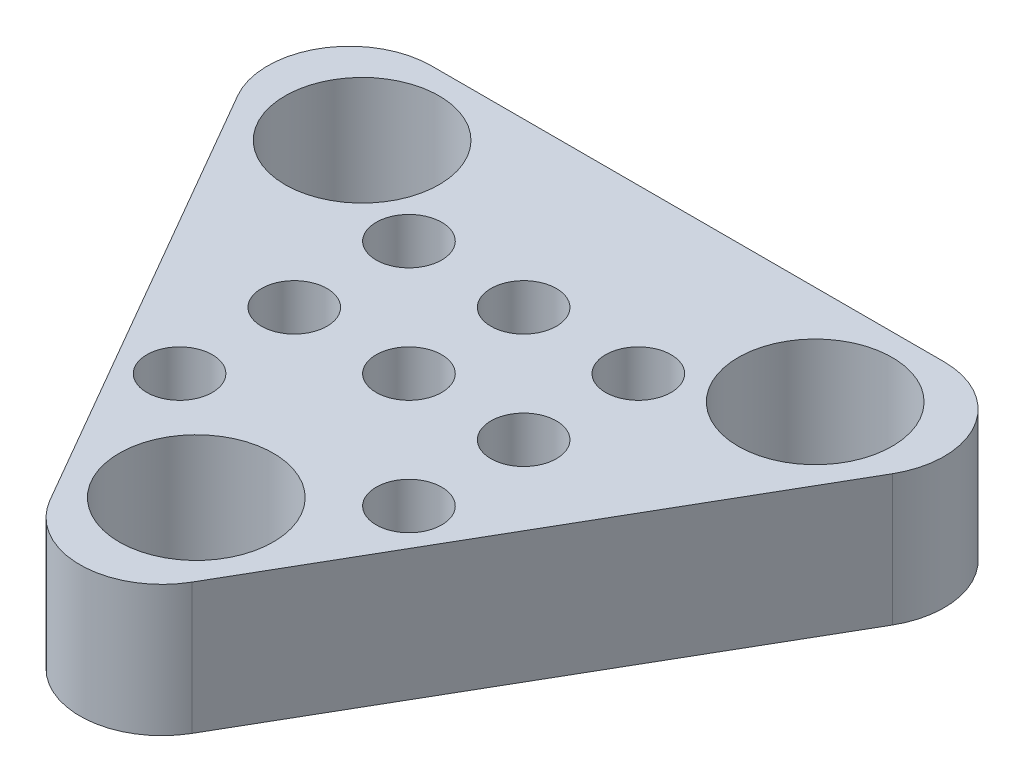
ISO-10303-21;
HEADER;
FILE_DESCRIPTION(('STEP AP214'),'2;1');
FILE_NAME('part.step','',(''),(''),'','','');
FILE_SCHEMA(('AUTOMOTIVE_DESIGN { 1 0 10303 214 1 1 1 1 }'));
ENDSEC;
DATA;
#1=APPLICATION_CONTEXT('core data for automotive mechanical design processes');
#2=APPLICATION_PROTOCOL_DEFINITION('international standard','automotive_design',2000,#1);
#3=PRODUCT_CONTEXT('',#1,'mechanical');
#4=PRODUCT('Part','Part','',(#3));
#5=PRODUCT_RELATED_PRODUCT_CATEGORY('part','',(#4));
#6=PRODUCT_DEFINITION_FORMATION('','',#4);
#7=PRODUCT_DEFINITION_CONTEXT('part definition',#1,'design');
#8=PRODUCT_DEFINITION('design','',#6,#7);
#9=PRODUCT_DEFINITION_SHAPE('','',#8);
#10=(LENGTH_UNIT() NAMED_UNIT(*) SI_UNIT(.MILLI.,.METRE.));
#11=(NAMED_UNIT(*) PLANE_ANGLE_UNIT() SI_UNIT($,.RADIAN.));
#12=(NAMED_UNIT(*) SI_UNIT($,.STERADIAN.) SOLID_ANGLE_UNIT());
#13=UNCERTAINTY_MEASURE_WITH_UNIT(LENGTH_MEASURE(1.E-05),#10,'distance_accuracy_value','');
#14=(GEOMETRIC_REPRESENTATION_CONTEXT(3) GLOBAL_UNCERTAINTY_ASSIGNED_CONTEXT((#13)) GLOBAL_UNIT_ASSIGNED_CONTEXT((#10,
#11,#12)) REPRESENTATION_CONTEXT('',''));
#15=CARTESIAN_POINT('',(0.,0.,0.));
#16=DIRECTION('',(0.,0.,1.));
#17=DIRECTION('',(1.,0.,0.));
#18=AXIS2_PLACEMENT_3D('',#15,#16,#17);
#19=CARTESIAN_POINT('',(-3.0209776379957,4.,-4.56619239929004));
#20=DIRECTION('',(0.,-1.,0.));
#21=DIRECTION('',(0.,0.,-1.));
#22=AXIS2_PLACEMENT_3D('',#19,#20,#21);
#23=PLANE('',#22);
#24=CARTESIAN_POINT('',(1.27033463203907,4.,4.91139789499105));
#25=DIRECTION('',(0.,1.,0.));
#26=DIRECTION('',(0.,0.,1.));
#27=AXIS2_PLACEMENT_3D('',#24,#25,#26);
#28=CIRCLE('',#27,0.999999999999769);
#29=CARTESIAN_POINT('',(1.27033463203907,4.,5.91139789499082));
#30=VERTEX_POINT('',#29);
#31=EDGE_CURVE('E216',#30,#30,#28,.T.);
#32=ORIENTED_EDGE('',*,*,#31,.F.);
#33=EDGE_LOOP('',(#32));
#34=FACE_BOUND('',#33,.T.);
#35=CARTESIAN_POINT('',(4.77033463203904,4.,1.41139789499105));
#36=DIRECTION('',(0.,1.,0.));
#37=DIRECTION('',(0.,0.,1.));
#38=AXIS2_PLACEMENT_3D('',#35,#36,#37);
#39=CIRCLE('',#38,0.999999999999769);
#40=CARTESIAN_POINT('',(4.77033463203904,4.,2.41139789499082));
#41=VERTEX_POINT('',#40);
#42=EDGE_CURVE('E228',#41,#41,#39,.T.);
#43=ORIENTED_EDGE('',*,*,#42,.F.);
#44=EDGE_LOOP('',(#43));
#45=FACE_BOUND('',#44,.T.);
#46=CARTESIAN_POINT('',(8.270334632039,4.,-2.08860210500895));
#47=DIRECTION('',(0.,1.,0.));
#48=DIRECTION('',(0.,0.,1.));
#49=AXIS2_PLACEMENT_3D('',#46,#47,#48);
#50=CIRCLE('',#49,0.999999999999769);
#51=CARTESIAN_POINT('',(8.270334632039,4.,-1.08860210500918));
#52=VERTEX_POINT('',#51);
#53=EDGE_CURVE('E240',#52,#52,#50,.T.);
#54=ORIENTED_EDGE('',*,*,#53,.F.);
#55=EDGE_LOOP('',(#54));
#56=FACE_BOUND('',#55,.T.);
#57=CARTESIAN_POINT('',(1.270334632039,4.,-2.08860210500895));
#58=DIRECTION('',(0.,1.,0.));
#59=DIRECTION('',(0.,0.,1.));
#60=AXIS2_PLACEMENT_3D('',#57,#58,#59);
#61=CIRCLE('',#60,0.999999999999769);
#62=CARTESIAN_POINT('',(1.270334632039,4.,-1.08860210500918));
#63=VERTEX_POINT('',#62);
#64=EDGE_CURVE('E252',#63,#63,#61,.T.);
#65=ORIENTED_EDGE('',*,*,#64,.F.);
#66=EDGE_LOOP('',(#65));
#67=FACE_BOUND('',#66,.T.);
#68=CARTESIAN_POINT('',(4.80279534308235,4.,7.93380760071011));
#69=DIRECTION('',(0.,1.,0.));
#70=DIRECTION('',(0.,0.,1.));
#71=AXIS2_PLACEMENT_3D('',#68,#69,#70);
#72=CIRCLE('',#71,2.34999999999962);
#73=CARTESIAN_POINT('',(4.80279534308235,4.,10.2838076007097));
#74=VERTEX_POINT('',#73);
#75=EDGE_CURVE('E264',#74,#74,#72,.T.);
#76=ORIENTED_EDGE('',*,*,#75,.F.);
#77=EDGE_LOOP('',(#76));
#78=FACE_BOUND('',#77,.T.);
#79=CARTESIAN_POINT('',(-3.0209776379957,4.,-4.56619239929004));
#80=DIRECTION('',(0.,1.,0.));
#81=DIRECTION('',(0.,0.,-1.));
#82=AXIS2_PLACEMENT_3D('',#79,#80,#81);
#83=CIRCLE('',#82,2.49999999999978);
#84=CARTESIAN_POINT('',(-3.02097763799564,4.,-7.0661923992899));
#85=VERTEX_POINT('',#84);
#86=CARTESIAN_POINT('',(-5.18604114745654,4.,-3.31619239929019));
#87=VERTEX_POINT('',#86);
#88=EDGE_CURVE('E127',#85,#87,#83,.T.);
#89=ORIENTED_EDGE('',*,*,#88,.T.);
#90=DIRECTION('',(0.500000000000009,0.,0.866025403784433));
#91=VECTOR('',#90,1.);
#92=CARTESIAN_POINT('',(-5.18604114745654,4.,-3.31619239929019));
#93=LINE('',#92,#91);
#94=CARTESIAN_POINT('',(2.63773183362179,4.,10.2349799108218));
#95=VERTEX_POINT('',#94);
#96=EDGE_CURVE('E85',#87,#95,#93,.T.);
#97=ORIENTED_EDGE('',*,*,#96,.T.);
#98=CARTESIAN_POINT('',(4.80279534308263,4.,8.98497991082193));
#99=DIRECTION('',(0.,1.,0.));
#100=DIRECTION('',(0.,0.,-1.));
#101=AXIS2_PLACEMENT_3D('',#98,#99,#100);
#102=CIRCLE('',#101,2.49999999999976);
#103=CARTESIAN_POINT('',(6.96785885254355,4.,10.2349799108217));
#104=VERTEX_POINT('',#103);
#105=EDGE_CURVE('E98',#95,#104,#102,.T.);
#106=ORIENTED_EDGE('',*,*,#105,.T.);
#107=DIRECTION('',(0.500000000000006,0.,-0.866025403784435));
#108=VECTOR('',#107,1.);
#109=CARTESIAN_POINT('',(6.9678588525436,4.,10.2349799108218));
#110=LINE('',#109,#108);
#111=CARTESIAN_POINT('',(14.7916318336219,4.,-3.3161923992902));
#112=VERTEX_POINT('',#111);
#113=EDGE_CURVE('E92',#104,#112,#110,.T.);
#114=ORIENTED_EDGE('',*,*,#113,.T.);
#115=CARTESIAN_POINT('',(12.6265683241609,4.,-4.56619239929004));
#116=DIRECTION('',(0.,1.,0.));
#117=DIRECTION('',(0.,0.,1.));
#118=AXIS2_PLACEMENT_3D('',#115,#116,#117);
#119=CIRCLE('',#118,2.49999999999983);
#120=CARTESIAN_POINT('',(12.626568324161,4.,-7.06619239928987));
#121=VERTEX_POINT('',#120);
#122=EDGE_CURVE('E96',#112,#121,#119,.T.);
#123=ORIENTED_EDGE('',*,*,#122,.T.);
#124=DIRECTION('',(-1.,0.,0.));
#125=VECTOR('',#124,1.);
#126=CARTESIAN_POINT('',(12.626568324161,4.,-7.0661923992899));
#127=LINE('',#126,#125);
#128=EDGE_CURVE('E48',#121,#85,#127,.T.);
#129=ORIENTED_EDGE('',*,*,#128,.T.);
#130=EDGE_LOOP('',(#89,#97,#106,#114,#123,#129));
#131=FACE_BOUND('',#130,.T.);
#132=CARTESIAN_POINT('',(-2.11063571368384,4.,-4.04060624423422));
#133=DIRECTION('',(0.,1.,0.));
#134=DIRECTION('',(0.,0.,1.));
#135=AXIS2_PLACEMENT_3D('',#132,#133,#134);
#136=CIRCLE('',#135,2.34999999999933);
#137=CARTESIAN_POINT('',(-2.11063571368384,4.,-1.69060624423489));
#138=VERTEX_POINT('',#137);
#139=EDGE_CURVE('E120',#138,#138,#136,.T.);
#140=ORIENTED_EDGE('',*,*,#139,.F.);
#141=EDGE_LOOP('',(#140));
#142=FACE_BOUND('',#141,.T.);
#143=CARTESIAN_POINT('',(11.7162263998492,4.,-4.04060624423421));
#144=DIRECTION('',(0.,1.,0.));
#145=DIRECTION('',(0.,0.,1.));
#146=AXIS2_PLACEMENT_3D('',#143,#144,#145);
#147=CIRCLE('',#146,2.34999999999945);
#148=CARTESIAN_POINT('',(11.7162263998492,4.,-1.69060624423475));
#149=VERTEX_POINT('',#148);
#150=EDGE_CURVE('E258',#149,#149,#147,.T.);
#151=ORIENTED_EDGE('',*,*,#150,.F.);
#152=EDGE_LOOP('',(#151));
#153=FACE_BOUND('',#152,.T.);
#154=CARTESIAN_POINT('',(4.770334632039,4.,-2.08860210500895));
#155=DIRECTION('',(0.,1.,0.));
#156=DIRECTION('',(0.,0.,1.));
#157=AXIS2_PLACEMENT_3D('',#154,#155,#156);
#158=CIRCLE('',#157,0.999999999999769);
#159=CARTESIAN_POINT('',(4.770334632039,4.,-1.08860210500918));
#160=VERTEX_POINT('',#159);
#161=EDGE_CURVE('E246',#160,#160,#158,.T.);
#162=ORIENTED_EDGE('',*,*,#161,.F.);
#163=EDGE_LOOP('',(#162));
#164=FACE_BOUND('',#163,.T.);
#165=CARTESIAN_POINT('',(1.27033463203904,4.,1.41139789499105));
#166=DIRECTION('',(0.,1.,0.));
#167=DIRECTION('',(0.,0.,1.));
#168=AXIS2_PLACEMENT_3D('',#165,#166,#167);
#169=CIRCLE('',#168,0.999999999999769);
#170=CARTESIAN_POINT('',(1.27033463203904,4.,2.41139789499082));
#171=VERTEX_POINT('',#170);
#172=EDGE_CURVE('E234',#171,#171,#169,.T.);
#173=ORIENTED_EDGE('',*,*,#172,.F.);
#174=EDGE_LOOP('',(#173));
#175=FACE_BOUND('',#174,.T.);
#176=CARTESIAN_POINT('',(8.27033463203903,4.,1.41139789499105));
#177=DIRECTION('',(0.,1.,0.));
#178=DIRECTION('',(0.,0.,1.));
#179=AXIS2_PLACEMENT_3D('',#176,#177,#178);
#180=CIRCLE('',#179,0.99999999999977);
#181=CARTESIAN_POINT('',(8.27033463203903,4.,2.41139789499083));
#182=VERTEX_POINT('',#181);
#183=EDGE_CURVE('E222',#182,#182,#180,.T.);
#184=ORIENTED_EDGE('',*,*,#183,.F.);
#185=EDGE_LOOP('',(#184));
#186=FACE_BOUND('',#185,.T.);
#187=CARTESIAN_POINT('',(8.27033463203907,4.,4.91139789499105));
#188=DIRECTION('',(0.,1.,0.));
#189=DIRECTION('',(0.,0.,1.));
#190=AXIS2_PLACEMENT_3D('',#187,#188,#189);
#191=CIRCLE('',#190,0.99999999999977);
#192=CARTESIAN_POINT('',(8.27033463203907,4.,5.91139789499083));
#193=VERTEX_POINT('',#192);
#194=EDGE_CURVE('E207',#193,#193,#191,.T.);
#195=ORIENTED_EDGE('',*,*,#194,.F.);
#196=EDGE_LOOP('',(#195));
#197=FACE_BOUND('',#196,.T.);
#198=ADVANCED_FACE('F31',(#34,#45,#56,#67,#78,#131,#142,#153,#164,#175,#186,#197),#23,.F.);
#199=CARTESIAN_POINT('',(-3.0209776379957,0.,-4.56619239929004));
#200=DIRECTION('',(0.,-1.,0.));
#201=DIRECTION('',(0.,0.,-1.));
#202=AXIS2_PLACEMENT_3D('',#199,#200,#201);
#203=PLANE('',#202);
#204=CARTESIAN_POINT('',(1.27033463203907,0.,4.91139789499105));
#205=DIRECTION('',(0.,1.,0.));
#206=DIRECTION('',(0.,0.,1.));
#207=AXIS2_PLACEMENT_3D('',#204,#205,#206);
#208=CIRCLE('',#207,0.999999999999769);
#209=CARTESIAN_POINT('',(1.27033463203907,0.,5.91139789499082));
#210=VERTEX_POINT('',#209);
#211=EDGE_CURVE('E213',#210,#210,#208,.T.);
#212=ORIENTED_EDGE('',*,*,#211,.T.);
#213=EDGE_LOOP('',(#212));
#214=FACE_BOUND('',#213,.T.);
#215=CARTESIAN_POINT('',(4.77033463203904,0.,1.41139789499105));
#216=DIRECTION('',(0.,1.,0.));
#217=DIRECTION('',(0.,0.,1.));
#218=AXIS2_PLACEMENT_3D('',#215,#216,#217);
#219=CIRCLE('',#218,0.999999999999769);
#220=CARTESIAN_POINT('',(4.77033463203904,0.,2.41139789499082));
#221=VERTEX_POINT('',#220);
#222=EDGE_CURVE('E225',#221,#221,#219,.T.);
#223=ORIENTED_EDGE('',*,*,#222,.T.);
#224=EDGE_LOOP('',(#223));
#225=FACE_BOUND('',#224,.T.);
#226=CARTESIAN_POINT('',(8.270334632039,0.,-2.08860210500895));
#227=DIRECTION('',(0.,1.,0.));
#228=DIRECTION('',(0.,0.,1.));
#229=AXIS2_PLACEMENT_3D('',#226,#227,#228);
#230=CIRCLE('',#229,0.999999999999769);
#231=CARTESIAN_POINT('',(8.270334632039,0.,-1.08860210500918));
#232=VERTEX_POINT('',#231);
#233=EDGE_CURVE('E237',#232,#232,#230,.T.);
#234=ORIENTED_EDGE('',*,*,#233,.T.);
#235=EDGE_LOOP('',(#234));
#236=FACE_BOUND('',#235,.T.);
#237=CARTESIAN_POINT('',(1.270334632039,0.,-2.08860210500895));
#238=DIRECTION('',(0.,1.,0.));
#239=DIRECTION('',(0.,0.,1.));
#240=AXIS2_PLACEMENT_3D('',#237,#238,#239);
#241=CIRCLE('',#240,0.999999999999769);
#242=CARTESIAN_POINT('',(1.270334632039,0.,-1.08860210500918));
#243=VERTEX_POINT('',#242);
#244=EDGE_CURVE('E249',#243,#243,#241,.T.);
#245=ORIENTED_EDGE('',*,*,#244,.T.);
#246=EDGE_LOOP('',(#245));
#247=FACE_BOUND('',#246,.T.);
#248=CARTESIAN_POINT('',(4.80279534308235,0.,7.93380760071011));
#249=DIRECTION('',(0.,1.,0.));
#250=DIRECTION('',(0.,0.,1.));
#251=AXIS2_PLACEMENT_3D('',#248,#249,#250);
#252=CIRCLE('',#251,2.34999999999962);
#253=CARTESIAN_POINT('',(4.80279534308235,0.,10.2838076007097));
#254=VERTEX_POINT('',#253);
#255=EDGE_CURVE('E261',#254,#254,#252,.T.);
#256=ORIENTED_EDGE('',*,*,#255,.T.);
#257=EDGE_LOOP('',(#256));
#258=FACE_BOUND('',#257,.T.);
#259=CARTESIAN_POINT('',(-3.0209776379957,0.,-4.56619239929004));
#260=DIRECTION('',(0.,1.,0.));
#261=DIRECTION('',(0.,0.,-1.));
#262=AXIS2_PLACEMENT_3D('',#259,#260,#261);
#263=CIRCLE('',#262,2.49999999999978);
#264=CARTESIAN_POINT('',(-3.02097763799564,0.,-7.0661923992899));
#265=VERTEX_POINT('',#264);
#266=CARTESIAN_POINT('',(-5.18604114745654,0.,-3.31619239929019));
#267=VERTEX_POINT('',#266);
#268=EDGE_CURVE('E116',#265,#267,#263,.T.);
#269=ORIENTED_EDGE('',*,*,#268,.F.);
#270=DIRECTION('',(-1.,0.,0.));
#271=VECTOR('',#270,1.);
#272=CARTESIAN_POINT('',(12.626568324161,0.,-7.0661923992899));
#273=LINE('',#272,#271);
#274=CARTESIAN_POINT('',(12.626568324161,0.,-7.06619239928987));
#275=VERTEX_POINT('',#274);
#276=EDGE_CURVE('E77',#275,#265,#273,.T.);
#277=ORIENTED_EDGE('',*,*,#276,.F.);
#278=CARTESIAN_POINT('',(12.6265683241609,0.,-4.56619239929004));
#279=DIRECTION('',(0.,1.,0.));
#280=DIRECTION('',(0.,0.,1.));
#281=AXIS2_PLACEMENT_3D('',#278,#279,#280);
#282=CIRCLE('',#281,2.49999999999983);
#283=CARTESIAN_POINT('',(14.7916318336219,0.,-3.3161923992902));
#284=VERTEX_POINT('',#283);
#285=EDGE_CURVE('E71',#284,#275,#282,.T.);
#286=ORIENTED_EDGE('',*,*,#285,.F.);
#287=DIRECTION('',(0.500000000000006,0.,-0.866025403784435));
#288=VECTOR('',#287,1.);
#289=CARTESIAN_POINT('',(6.9678588525436,0.,10.2349799108218));
#290=LINE('',#289,#288);
#291=CARTESIAN_POINT('',(6.96785885254355,0.,10.2349799108217));
#292=VERTEX_POINT('',#291);
#293=EDGE_CURVE('E106',#292,#284,#290,.T.);
#294=ORIENTED_EDGE('',*,*,#293,.F.);
#295=CARTESIAN_POINT('',(4.80279534308263,0.,8.98497991082193));
#296=DIRECTION('',(0.,1.,0.));
#297=DIRECTION('',(0.,0.,-1.));
#298=AXIS2_PLACEMENT_3D('',#295,#296,#297);
#299=CIRCLE('',#298,2.49999999999976);
#300=CARTESIAN_POINT('',(2.63773183362179,0.,10.2349799108218));
#301=VERTEX_POINT('',#300);
#302=EDGE_CURVE('E122',#301,#292,#299,.T.);
#303=ORIENTED_EDGE('',*,*,#302,.F.);
#304=DIRECTION('',(0.500000000000009,0.,0.866025403784433));
#305=VECTOR('',#304,1.);
#306=CARTESIAN_POINT('',(-5.18604114745654,0.,-3.31619239929019));
#307=LINE('',#306,#305);
#308=EDGE_CURVE('E119',#267,#301,#307,.T.);
#309=ORIENTED_EDGE('',*,*,#308,.F.);
#310=EDGE_LOOP('',(#269,#277,#286,#294,#303,#309));
#311=FACE_BOUND('',#310,.T.);
#312=CARTESIAN_POINT('',(-2.11063571368384,0.,-4.04060624423422));
#313=DIRECTION('',(0.,1.,0.));
#314=DIRECTION('',(0.,0.,1.));
#315=AXIS2_PLACEMENT_3D('',#312,#313,#314);
#316=CIRCLE('',#315,2.34999999999933);
#317=CARTESIAN_POINT('',(-2.11063571368384,0.,-1.69060624423489));
#318=VERTEX_POINT('',#317);
#319=EDGE_CURVE('E267',#318,#318,#316,.T.);
#320=ORIENTED_EDGE('',*,*,#319,.T.);
#321=EDGE_LOOP('',(#320));
#322=FACE_BOUND('',#321,.T.);
#323=CARTESIAN_POINT('',(11.7162263998492,0.,-4.04060624423421));
#324=DIRECTION('',(0.,1.,0.));
#325=DIRECTION('',(0.,0.,1.));
#326=AXIS2_PLACEMENT_3D('',#323,#324,#325);
#327=CIRCLE('',#326,2.34999999999945);
#328=CARTESIAN_POINT('',(11.7162263998492,0.,-1.69060624423475));
#329=VERTEX_POINT('',#328);
#330=EDGE_CURVE('E255',#329,#329,#327,.T.);
#331=ORIENTED_EDGE('',*,*,#330,.T.);
#332=EDGE_LOOP('',(#331));
#333=FACE_BOUND('',#332,.T.);
#334=CARTESIAN_POINT('',(4.770334632039,0.,-2.08860210500895));
#335=DIRECTION('',(0.,1.,0.));
#336=DIRECTION('',(0.,0.,1.));
#337=AXIS2_PLACEMENT_3D('',#334,#335,#336);
#338=CIRCLE('',#337,0.999999999999769);
#339=CARTESIAN_POINT('',(4.770334632039,0.,-1.08860210500918));
#340=VERTEX_POINT('',#339);
#341=EDGE_CURVE('E243',#340,#340,#338,.T.);
#342=ORIENTED_EDGE('',*,*,#341,.T.);
#343=EDGE_LOOP('',(#342));
#344=FACE_BOUND('',#343,.T.);
#345=CARTESIAN_POINT('',(1.27033463203904,0.,1.41139789499105));
#346=DIRECTION('',(0.,1.,0.));
#347=DIRECTION('',(0.,0.,1.));
#348=AXIS2_PLACEMENT_3D('',#345,#346,#347);
#349=CIRCLE('',#348,0.999999999999769);
#350=CARTESIAN_POINT('',(1.27033463203904,0.,2.41139789499082));
#351=VERTEX_POINT('',#350);
#352=EDGE_CURVE('E231',#351,#351,#349,.T.);
#353=ORIENTED_EDGE('',*,*,#352,.T.);
#354=EDGE_LOOP('',(#353));
#355=FACE_BOUND('',#354,.T.);
#356=CARTESIAN_POINT('',(8.27033463203903,0.,1.41139789499105));
#357=DIRECTION('',(0.,1.,0.));
#358=DIRECTION('',(0.,0.,1.));
#359=AXIS2_PLACEMENT_3D('',#356,#357,#358);
#360=CIRCLE('',#359,0.99999999999977);
#361=CARTESIAN_POINT('',(8.27033463203903,0.,2.41139789499083));
#362=VERTEX_POINT('',#361);
#363=EDGE_CURVE('E219',#362,#362,#360,.T.);
#364=ORIENTED_EDGE('',*,*,#363,.T.);
#365=EDGE_LOOP('',(#364));
#366=FACE_BOUND('',#365,.T.);
#367=CARTESIAN_POINT('',(8.27033463203907,0.,4.91139789499105));
#368=DIRECTION('',(0.,1.,0.));
#369=DIRECTION('',(0.,0.,1.));
#370=AXIS2_PLACEMENT_3D('',#367,#368,#369);
#371=CIRCLE('',#370,0.99999999999977);
#372=CARTESIAN_POINT('',(8.27033463203907,0.,5.91139789499083));
#373=VERTEX_POINT('',#372);
#374=EDGE_CURVE('E210',#373,#373,#371,.T.);
#375=ORIENTED_EDGE('',*,*,#374,.T.);
#376=EDGE_LOOP('',(#375));
#377=FACE_BOUND('',#376,.T.);
#378=ADVANCED_FACE('F136',(#214,#225,#236,#247,#258,#311,#322,#333,#344,#355,#366,#377),#203,.T.);
#379=CARTESIAN_POINT('',(-3.0209776379957,4.,-4.56619239929004));
#380=DIRECTION('',(0.,-1.,0.));
#381=DIRECTION('',(0.,0.,-1.));
#382=AXIS2_PLACEMENT_3D('',#379,#380,#381);
#383=CYLINDRICAL_SURFACE('',#382,2.49999999999978);
#384=ORIENTED_EDGE('',*,*,#268,.T.);
#385=DIRECTION('',(0.,-1.,0.));
#386=VECTOR('',#385,1.);
#387=CARTESIAN_POINT('',(-5.18604114745654,4.,-3.31619239929019));
#388=LINE('',#387,#386);
#389=EDGE_CURVE('E11',#87,#267,#388,.T.);
#390=ORIENTED_EDGE('',*,*,#389,.F.);
#391=ORIENTED_EDGE('',*,*,#88,.F.);
#392=DIRECTION('',(0.,-1.,0.));
#393=VECTOR('',#392,1.);
#394=CARTESIAN_POINT('',(-3.02097763799564,4.,-7.0661923992899));
#395=LINE('',#394,#393);
#396=EDGE_CURVE('E112',#85,#265,#395,.T.);
#397=ORIENTED_EDGE('',*,*,#396,.T.);
#398=EDGE_LOOP('',(#384,#390,#391,#397));
#399=FACE_BOUND('',#398,.T.);
#400=ADVANCED_FACE('F33',(#399),#383,.T.);
#401=CARTESIAN_POINT('',(-5.18604114745654,4.,-3.31619239929019));
#402=DIRECTION('',(0.866025403784433,0.,-0.500000000000009));
#403=DIRECTION('',(-0.500000000000009,0.,-0.866025403784434));
#404=AXIS2_PLACEMENT_3D('',#401,#402,#403);
#405=PLANE('',#404);
#406=ORIENTED_EDGE('',*,*,#308,.T.);
#407=DIRECTION('',(0.,-1.,0.));
#408=VECTOR('',#407,1.);
#409=CARTESIAN_POINT('',(2.63773183362179,4.,10.2349799108218));
#410=LINE('',#409,#408);
#411=EDGE_CURVE('E40',#95,#301,#410,.T.);
#412=ORIENTED_EDGE('',*,*,#411,.F.);
#413=ORIENTED_EDGE('',*,*,#96,.F.);
#414=ORIENTED_EDGE('',*,*,#389,.T.);
#415=EDGE_LOOP('',(#406,#412,#413,#414));
#416=FACE_BOUND('',#415,.T.);
#417=ADVANCED_FACE('F387',(#416),#405,.F.);
#418=CARTESIAN_POINT('',(4.80279534308263,4.,8.98497991082193));
#419=DIRECTION('',(0.,-1.,0.));
#420=DIRECTION('',(0.,0.,-1.));
#421=AXIS2_PLACEMENT_3D('',#418,#419,#420);
#422=CYLINDRICAL_SURFACE('',#421,2.49999999999976);
#423=ORIENTED_EDGE('',*,*,#302,.T.);
#424=DIRECTION('',(0.,-1.,0.));
#425=VECTOR('',#424,1.);
#426=CARTESIAN_POINT('',(6.96785885254355,4.,10.2349799108217));
#427=LINE('',#426,#425);
#428=EDGE_CURVE('E107',#104,#292,#427,.T.);
#429=ORIENTED_EDGE('',*,*,#428,.F.);
#430=ORIENTED_EDGE('',*,*,#105,.F.);
#431=ORIENTED_EDGE('',*,*,#411,.T.);
#432=EDGE_LOOP('',(#423,#429,#430,#431));
#433=FACE_BOUND('',#432,.T.);
#434=ADVANCED_FACE('F133',(#433),#422,.T.);
#435=CARTESIAN_POINT('',(6.9678588525436,4.,10.2349799108218));
#436=DIRECTION('',(-0.866025403784435,0.,-0.500000000000006));
#437=DIRECTION('',(-0.500000000000006,0.,0.866025403784435));
#438=AXIS2_PLACEMENT_3D('',#435,#436,#437);
#439=PLANE('',#438);
#440=ORIENTED_EDGE('',*,*,#293,.T.);
#441=DIRECTION('',(0.,-1.,0.));
#442=VECTOR('',#441,1.);
#443=CARTESIAN_POINT('',(14.7916318336219,4.,-3.3161923992902));
#444=LINE('',#443,#442);
#445=EDGE_CURVE('E103',#112,#284,#444,.T.);
#446=ORIENTED_EDGE('',*,*,#445,.F.);
#447=ORIENTED_EDGE('',*,*,#113,.F.);
#448=ORIENTED_EDGE('',*,*,#428,.T.);
#449=EDGE_LOOP('',(#440,#446,#447,#448));
#450=FACE_BOUND('',#449,.T.);
#451=ADVANCED_FACE('F104',(#450),#439,.F.);
#452=CARTESIAN_POINT('',(12.6265683241609,4.,-4.56619239929004));
#453=DIRECTION('',(0.,-1.,0.));
#454=DIRECTION('',(0.,0.,-1.));
#455=AXIS2_PLACEMENT_3D('',#452,#453,#454);
#456=CYLINDRICAL_SURFACE('',#455,2.49999999999983);
#457=ORIENTED_EDGE('',*,*,#285,.T.);
#458=DIRECTION('',(0.,-1.,0.));
#459=VECTOR('',#458,1.);
#460=CARTESIAN_POINT('',(12.626568324161,4.,-7.06619239928987));
#461=LINE('',#460,#459);
#462=EDGE_CURVE('E108',#121,#275,#461,.T.);
#463=ORIENTED_EDGE('',*,*,#462,.F.);
#464=ORIENTED_EDGE('',*,*,#122,.F.);
#465=ORIENTED_EDGE('',*,*,#445,.T.);
#466=EDGE_LOOP('',(#457,#463,#464,#465));
#467=FACE_BOUND('',#466,.T.);
#468=ADVANCED_FACE('F110',(#467),#456,.T.);
#469=CARTESIAN_POINT('',(12.626568324161,4.,-7.0661923992899));
#470=DIRECTION('',(0.,0.,1.));
#471=DIRECTION('',(1.,0.,0.));
#472=AXIS2_PLACEMENT_3D('',#469,#470,#471);
#473=PLANE('',#472);
#474=ORIENTED_EDGE('',*,*,#276,.T.);
#475=ORIENTED_EDGE('',*,*,#396,.F.);
#476=ORIENTED_EDGE('',*,*,#128,.F.);
#477=ORIENTED_EDGE('',*,*,#462,.T.);
#478=EDGE_LOOP('',(#474,#475,#476,#477));
#479=FACE_BOUND('',#478,.T.);
#480=ADVANCED_FACE('F141',(#479),#473,.F.);
#481=CARTESIAN_POINT('',(-2.11063571368384,4.,-4.04060624423422));
#482=DIRECTION('',(0.,-1.,0.));
#483=DIRECTION('',(0.,0.,-1.));
#484=AXIS2_PLACEMENT_3D('',#481,#482,#483);
#485=CYLINDRICAL_SURFACE('',#484,2.34999999999933);
#486=ORIENTED_EDGE('',*,*,#139,.T.);
#487=EDGE_LOOP('',(#486));
#488=FACE_BOUND('',#487,.T.);
#489=ORIENTED_EDGE('',*,*,#319,.F.);
#490=EDGE_LOOP('',(#489));
#491=FACE_BOUND('',#490,.T.);
#492=ADVANCED_FACE('F143',(#488,#491),#485,.F.);
#493=CARTESIAN_POINT('',(4.80279534308235,4.,7.93380760071011));
#494=DIRECTION('',(0.,-1.,0.));
#495=DIRECTION('',(0.,0.,-1.));
#496=AXIS2_PLACEMENT_3D('',#493,#494,#495);
#497=CYLINDRICAL_SURFACE('',#496,2.34999999999962);
#498=ORIENTED_EDGE('',*,*,#75,.T.);
#499=EDGE_LOOP('',(#498));
#500=FACE_BOUND('',#499,.T.);
#501=ORIENTED_EDGE('',*,*,#255,.F.);
#502=EDGE_LOOP('',(#501));
#503=FACE_BOUND('',#502,.T.);
#504=ADVANCED_FACE('F149',(#500,#503),#497,.F.);
#505=CARTESIAN_POINT('',(11.7162263998492,4.,-4.04060624423421));
#506=DIRECTION('',(0.,-1.,0.));
#507=DIRECTION('',(0.,0.,-1.));
#508=AXIS2_PLACEMENT_3D('',#505,#506,#507);
#509=CYLINDRICAL_SURFACE('',#508,2.34999999999945);
#510=ORIENTED_EDGE('',*,*,#150,.T.);
#511=EDGE_LOOP('',(#510));
#512=FACE_BOUND('',#511,.T.);
#513=ORIENTED_EDGE('',*,*,#330,.F.);
#514=EDGE_LOOP('',(#513));
#515=FACE_BOUND('',#514,.T.);
#516=ADVANCED_FACE('F166',(#512,#515),#509,.F.);
#517=CARTESIAN_POINT('',(1.270334632039,4.,-2.08860210500895));
#518=DIRECTION('',(0.,-1.,0.));
#519=DIRECTION('',(0.,0.,-1.));
#520=AXIS2_PLACEMENT_3D('',#517,#518,#519);
#521=CYLINDRICAL_SURFACE('',#520,0.999999999999769);
#522=ORIENTED_EDGE('',*,*,#64,.T.);
#523=EDGE_LOOP('',(#522));
#524=FACE_BOUND('',#523,.T.);
#525=ORIENTED_EDGE('',*,*,#244,.F.);
#526=EDGE_LOOP('',(#525));
#527=FACE_BOUND('',#526,.T.);
#528=ADVANCED_FACE('F170',(#524,#527),#521,.F.);
#529=CARTESIAN_POINT('',(4.770334632039,4.,-2.08860210500895));
#530=DIRECTION('',(0.,-1.,0.));
#531=DIRECTION('',(0.,0.,-1.));
#532=AXIS2_PLACEMENT_3D('',#529,#530,#531);
#533=CYLINDRICAL_SURFACE('',#532,0.999999999999769);
#534=ORIENTED_EDGE('',*,*,#161,.T.);
#535=EDGE_LOOP('',(#534));
#536=FACE_BOUND('',#535,.T.);
#537=ORIENTED_EDGE('',*,*,#341,.F.);
#538=EDGE_LOOP('',(#537));
#539=FACE_BOUND('',#538,.T.);
#540=ADVANCED_FACE('F174',(#536,#539),#533,.F.);
#541=CARTESIAN_POINT('',(8.270334632039,4.,-2.08860210500895));
#542=DIRECTION('',(0.,-1.,0.));
#543=DIRECTION('',(0.,0.,-1.));
#544=AXIS2_PLACEMENT_3D('',#541,#542,#543);
#545=CYLINDRICAL_SURFACE('',#544,0.999999999999769);
#546=ORIENTED_EDGE('',*,*,#53,.T.);
#547=EDGE_LOOP('',(#546));
#548=FACE_BOUND('',#547,.T.);
#549=ORIENTED_EDGE('',*,*,#233,.F.);
#550=EDGE_LOOP('',(#549));
#551=FACE_BOUND('',#550,.T.);
#552=ADVANCED_FACE('F178',(#548,#551),#545,.F.);
#553=CARTESIAN_POINT('',(1.27033463203904,4.,1.41139789499105));
#554=DIRECTION('',(0.,-1.,0.));
#555=DIRECTION('',(0.,0.,-1.));
#556=AXIS2_PLACEMENT_3D('',#553,#554,#555);
#557=CYLINDRICAL_SURFACE('',#556,0.999999999999769);
#558=ORIENTED_EDGE('',*,*,#172,.T.);
#559=EDGE_LOOP('',(#558));
#560=FACE_BOUND('',#559,.T.);
#561=ORIENTED_EDGE('',*,*,#352,.F.);
#562=EDGE_LOOP('',(#561));
#563=FACE_BOUND('',#562,.T.);
#564=ADVANCED_FACE('F182',(#560,#563),#557,.F.);
#565=CARTESIAN_POINT('',(4.77033463203904,4.,1.41139789499105));
#566=DIRECTION('',(0.,-1.,0.));
#567=DIRECTION('',(0.,0.,-1.));
#568=AXIS2_PLACEMENT_3D('',#565,#566,#567);
#569=CYLINDRICAL_SURFACE('',#568,0.999999999999769);
#570=ORIENTED_EDGE('',*,*,#42,.T.);
#571=EDGE_LOOP('',(#570));
#572=FACE_BOUND('',#571,.T.);
#573=ORIENTED_EDGE('',*,*,#222,.F.);
#574=EDGE_LOOP('',(#573));
#575=FACE_BOUND('',#574,.T.);
#576=ADVANCED_FACE('F186',(#572,#575),#569,.F.);
#577=CARTESIAN_POINT('',(8.27033463203903,4.,1.41139789499105));
#578=DIRECTION('',(0.,-1.,0.));
#579=DIRECTION('',(0.,0.,-1.));
#580=AXIS2_PLACEMENT_3D('',#577,#578,#579);
#581=CYLINDRICAL_SURFACE('',#580,0.99999999999977);
#582=ORIENTED_EDGE('',*,*,#183,.T.);
#583=EDGE_LOOP('',(#582));
#584=FACE_BOUND('',#583,.T.);
#585=ORIENTED_EDGE('',*,*,#363,.F.);
#586=EDGE_LOOP('',(#585));
#587=FACE_BOUND('',#586,.T.);
#588=ADVANCED_FACE('F190',(#584,#587),#581,.F.);
#589=CARTESIAN_POINT('',(1.27033463203907,4.,4.91139789499105));
#590=DIRECTION('',(0.,-1.,0.));
#591=DIRECTION('',(0.,0.,-1.));
#592=AXIS2_PLACEMENT_3D('',#589,#590,#591);
#593=CYLINDRICAL_SURFACE('',#592,0.999999999999769);
#594=ORIENTED_EDGE('',*,*,#31,.T.);
#595=EDGE_LOOP('',(#594));
#596=FACE_BOUND('',#595,.T.);
#597=ORIENTED_EDGE('',*,*,#211,.F.);
#598=EDGE_LOOP('',(#597));
#599=FACE_BOUND('',#598,.T.);
#600=ADVANCED_FACE('F194',(#596,#599),#593,.F.);
#601=CARTESIAN_POINT('',(8.27033463203907,4.,4.91139789499105));
#602=DIRECTION('',(0.,-1.,0.));
#603=DIRECTION('',(0.,0.,-1.));
#604=AXIS2_PLACEMENT_3D('',#601,#602,#603);
#605=CYLINDRICAL_SURFACE('',#604,0.99999999999977);
#606=ORIENTED_EDGE('',*,*,#194,.T.);
#607=EDGE_LOOP('',(#606));
#608=FACE_BOUND('',#607,.T.);
#609=ORIENTED_EDGE('',*,*,#374,.F.);
#610=EDGE_LOOP('',(#609));
#611=FACE_BOUND('',#610,.T.);
#612=ADVANCED_FACE('F198',(#608,#611),#605,.F.);
#613=CLOSED_SHELL('',(#198,#378,#400,#417,#434,#451,#468,#480,#492,#504,#516,#528,#540,#552,
#564,#576,#588,#600,#612));
#614=MANIFOLD_SOLID_BREP('B2',#613);
#615=ADVANCED_BREP_SHAPE_REPRESENTATION('',(#18,#614),#14);
#616=SHAPE_DEFINITION_REPRESENTATION(#9,#615);
ENDSEC;
END-ISO-10303-21;
